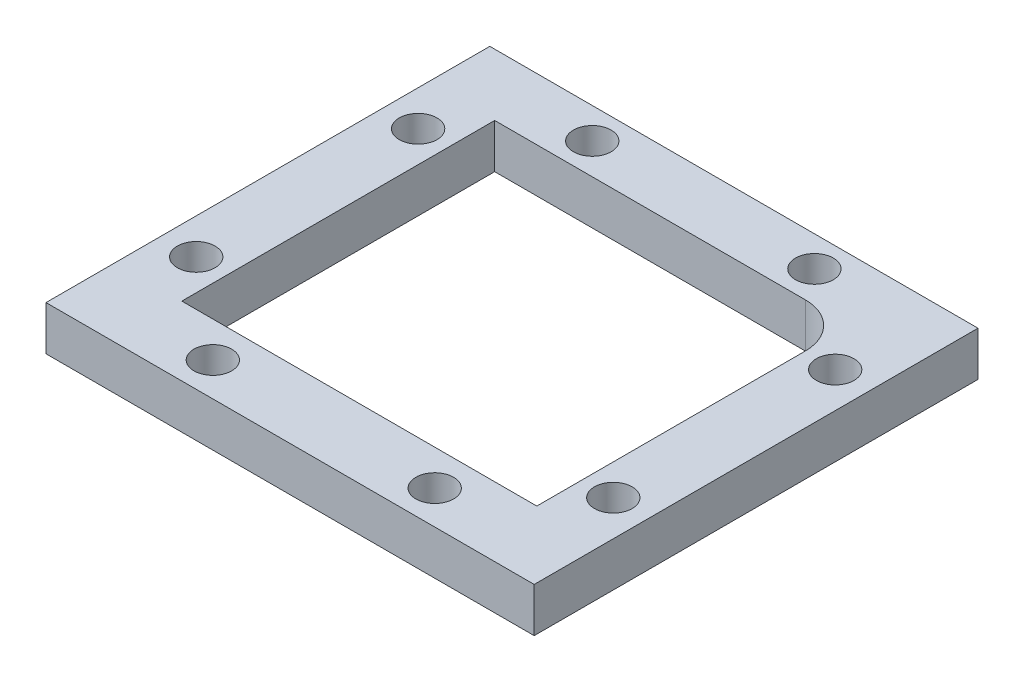
ISO-10303-21;
HEADER;
FILE_DESCRIPTION(('STEP AP214'),'2;1');
FILE_NAME('part.step','',(''),(''),'','','');
FILE_SCHEMA(('AUTOMOTIVE_DESIGN { 1 0 10303 214 1 1 1 1 }'));
ENDSEC;
DATA;
#1=APPLICATION_CONTEXT('core data for automotive mechanical design processes');
#2=APPLICATION_PROTOCOL_DEFINITION('international standard','automotive_design',2000,#1);
#3=PRODUCT_CONTEXT('',#1,'mechanical');
#4=PRODUCT('Part','Part','',(#3));
#5=PRODUCT_RELATED_PRODUCT_CATEGORY('part','',(#4));
#6=PRODUCT_DEFINITION_FORMATION('','',#4);
#7=PRODUCT_DEFINITION_CONTEXT('part definition',#1,'design');
#8=PRODUCT_DEFINITION('design','',#6,#7);
#9=PRODUCT_DEFINITION_SHAPE('','',#8);
#10=(LENGTH_UNIT() NAMED_UNIT(*) SI_UNIT(.MILLI.,.METRE.));
#11=(NAMED_UNIT(*) PLANE_ANGLE_UNIT() SI_UNIT($,.RADIAN.));
#12=(NAMED_UNIT(*) SI_UNIT($,.STERADIAN.) SOLID_ANGLE_UNIT());
#13=UNCERTAINTY_MEASURE_WITH_UNIT(LENGTH_MEASURE(1.E-05),#10,'distance_accuracy_value','');
#14=(GEOMETRIC_REPRESENTATION_CONTEXT(3) GLOBAL_UNCERTAINTY_ASSIGNED_CONTEXT((#13)) GLOBAL_UNIT_ASSIGNED_CONTEXT((#10,
#11,#12)) REPRESENTATION_CONTEXT('',''));
#15=CARTESIAN_POINT('',(0.,0.,0.));
#16=DIRECTION('',(0.,0.,1.));
#17=DIRECTION('',(1.,0.,0.));
#18=AXIS2_PLACEMENT_3D('',#15,#16,#17);
#19=CARTESIAN_POINT('',(0.,35.,0.));
#20=DIRECTION('',(0.,-1.,0.));
#21=DIRECTION('',(0.,0.,-1.));
#22=AXIS2_PLACEMENT_3D('',#19,#20,#21);
#23=PLANE('',#22);
#24=CARTESIAN_POINT('',(-23.4936005393496,35.,10.125));
#25=DIRECTION('',(0.,-1.,0.));
#26=DIRECTION('',(0.,0.,-1.));
#27=AXIS2_PLACEMENT_3D('',#24,#25,#26);
#28=CIRCLE('',#27,2.125);
#29=CARTESIAN_POINT('',(-23.4936005393496,35.,8.));
#30=VERTEX_POINT('',#29);
#31=EDGE_CURVE('E320',#30,#30,#28,.T.);
#32=ORIENTED_EDGE('',*,*,#31,.T.);
#33=EDGE_LOOP('',(#32));
#34=FACE_BOUND('',#33,.T.);
#35=CARTESIAN_POINT('',(12.5,35.,-23.5265194709854));
#36=DIRECTION('',(0.,-1.,0.));
#37=DIRECTION('',(0.,0.,-1.));
#38=AXIS2_PLACEMENT_3D('',#35,#36,#37);
#39=CIRCLE('',#38,2.125);
#40=CARTESIAN_POINT('',(12.5,35.,-25.6515194709854));
#41=VERTEX_POINT('',#40);
#42=EDGE_CURVE('E313',#41,#41,#39,.T.);
#43=ORIENTED_EDGE('',*,*,#42,.T.);
#44=EDGE_LOOP('',(#43));
#45=FACE_BOUND('',#44,.T.);
#46=CARTESIAN_POINT('',(-12.5,35.,-23.5));
#47=DIRECTION('',(0.,-1.,0.));
#48=DIRECTION('',(0.,0.,-1.));
#49=AXIS2_PLACEMENT_3D('',#46,#47,#48);
#50=CIRCLE('',#49,2.125);
#51=CARTESIAN_POINT('',(-12.5,35.,-25.625));
#52=VERTEX_POINT('',#51);
#53=EDGE_CURVE('E331',#52,#52,#50,.T.);
#54=ORIENTED_EDGE('',*,*,#53,.T.);
#55=EDGE_LOOP('',(#54));
#56=FACE_BOUND('',#55,.T.);
#57=CARTESIAN_POINT('',(12.5,35.,19.25));
#58=DIRECTION('',(0.,-1.,0.));
#59=DIRECTION('',(0.,0.,-1.));
#60=AXIS2_PLACEMENT_3D('',#57,#58,#59);
#61=CIRCLE('',#60,2.125);
#62=CARTESIAN_POINT('',(12.5,35.,17.125));
#63=VERTEX_POINT('',#62);
#64=EDGE_CURVE('E324',#63,#63,#61,.T.);
#65=ORIENTED_EDGE('',*,*,#64,.T.);
#66=EDGE_LOOP('',(#65));
#67=FACE_BOUND('',#66,.T.);
#68=CARTESIAN_POINT('',(-23.4936005393496,35.,-14.875));
#69=DIRECTION('',(0.,-1.,0.));
#70=DIRECTION('',(0.,0.,-1.));
#71=AXIS2_PLACEMENT_3D('',#68,#69,#70);
#72=CIRCLE('',#71,2.125);
#73=CARTESIAN_POINT('',(-23.4936005393496,35.,-17.));
#74=VERTEX_POINT('',#73);
#75=EDGE_CURVE('E292',#74,#74,#72,.T.);
#76=ORIENTED_EDGE('',*,*,#75,.T.);
#77=EDGE_LOOP('',(#76));
#78=FACE_BOUND('',#77,.T.);
#79=CARTESIAN_POINT('',(23.4936005393496,35.,-14.875));
#80=DIRECTION('',(0.,-1.,0.));
#81=DIRECTION('',(0.,0.,1.));
#82=AXIS2_PLACEMENT_3D('',#79,#80,#81);
#83=CIRCLE('',#82,2.125);
#84=CARTESIAN_POINT('',(23.4936005393496,35.,-12.75));
#85=VERTEX_POINT('',#84);
#86=EDGE_CURVE('E297',#85,#85,#83,.T.);
#87=ORIENTED_EDGE('',*,*,#86,.T.);
#88=EDGE_LOOP('',(#87));
#89=FACE_BOUND('',#88,.T.);
#90=CARTESIAN_POINT('',(23.4936005393496,35.,10.125));
#91=DIRECTION('',(0.,-1.,0.));
#92=DIRECTION('',(0.,0.,1.));
#93=AXIS2_PLACEMENT_3D('',#90,#91,#92);
#94=CIRCLE('',#93,2.125);
#95=CARTESIAN_POINT('',(23.4936005393496,35.,12.25));
#96=VERTEX_POINT('',#95);
#97=EDGE_CURVE('E307',#96,#96,#94,.T.);
#98=ORIENTED_EDGE('',*,*,#97,.T.);
#99=EDGE_LOOP('',(#98));
#100=FACE_BOUND('',#99,.T.);
#101=CARTESIAN_POINT('',(-12.5,35.,19.25));
#102=DIRECTION('',(0.,-1.,0.));
#103=DIRECTION('',(0.,0.,-1.));
#104=AXIS2_PLACEMENT_3D('',#101,#102,#103);
#105=CIRCLE('',#104,2.125);
#106=CARTESIAN_POINT('',(-12.5,35.,17.125));
#107=VERTEX_POINT('',#106);
#108=EDGE_CURVE('E158',#107,#107,#105,.T.);
#109=ORIENTED_EDGE('',*,*,#108,.T.);
#110=EDGE_LOOP('',(#109));
#111=FACE_BOUND('',#110,.T.);
#112=DIRECTION('',(0.,0.,-1.));
#113=VECTOR('',#112,1.);
#114=CARTESIAN_POINT('',(27.5,35.,23.0435212218331));
#115=LINE('',#114,#113);
#116=CARTESIAN_POINT('',(27.5,35.,23.0435212218331));
#117=VERTEX_POINT('',#116);
#118=CARTESIAN_POINT('',(27.5,35.,-26.9564787781669));
#119=VERTEX_POINT('',#118);
#120=EDGE_CURVE('E173',#117,#119,#115,.T.);
#121=ORIENTED_EDGE('',*,*,#120,.T.);
#122=DIRECTION('',(-1.,0.,0.));
#123=VECTOR('',#122,1.);
#124=CARTESIAN_POINT('',(-27.5,35.,-26.9564787781669));
#125=LINE('',#124,#123);
#126=CARTESIAN_POINT('',(-27.5,35.,-26.9564787781669));
#127=VERTEX_POINT('',#126);
#128=EDGE_CURVE('E176',#119,#127,#125,.T.);
#129=ORIENTED_EDGE('',*,*,#128,.T.);
#130=DIRECTION('',(0.,0.,1.));
#131=VECTOR('',#130,1.);
#132=CARTESIAN_POINT('',(-27.5,35.,23.0435212218331));
#133=LINE('',#132,#131);
#134=CARTESIAN_POINT('',(-27.5,35.,23.0435212218331));
#135=VERTEX_POINT('',#134);
#136=EDGE_CURVE('E179',#127,#135,#133,.T.);
#137=ORIENTED_EDGE('',*,*,#136,.T.);
#138=DIRECTION('',(1.,0.,0.));
#139=VECTOR('',#138,1.);
#140=CARTESIAN_POINT('',(-27.5,35.,23.0435212218331));
#141=LINE('',#140,#139);
#142=EDGE_CURVE('E181',#135,#117,#141,.T.);
#143=ORIENTED_EDGE('',*,*,#142,.T.);
#144=EDGE_LOOP('',(#121,#129,#137,#143));
#145=FACE_BOUND('',#144,.T.);
#146=CARTESIAN_POINT('',(15.,35.,-15.));
#147=DIRECTION('',(0.,1.,0.));
#148=DIRECTION('',(0.,0.,1.));
#149=AXIS2_PLACEMENT_3D('',#146,#147,#148);
#150=CIRCLE('',#149,5.);
#151=CARTESIAN_POINT('',(20.,35.,-15.));
#152=VERTEX_POINT('',#151);
#153=CARTESIAN_POINT('',(15.,35.,-20.));
#154=VERTEX_POINT('',#153);
#155=EDGE_CURVE('E127',#152,#154,#150,.T.);
#156=ORIENTED_EDGE('',*,*,#155,.F.);
#157=DIRECTION('',(0.,0.,-1.));
#158=VECTOR('',#157,1.);
#159=CARTESIAN_POINT('',(20.,35.,15.25));
#160=LINE('',#159,#158);
#161=CARTESIAN_POINT('',(20.,35.,15.25));
#162=VERTEX_POINT('',#161);
#163=EDGE_CURVE('E155',#162,#152,#160,.T.);
#164=ORIENTED_EDGE('',*,*,#163,.F.);
#165=DIRECTION('',(1.,0.,0.));
#166=VECTOR('',#165,1.);
#167=CARTESIAN_POINT('',(-19.9936005393496,35.,15.25));
#168=LINE('',#167,#166);
#169=CARTESIAN_POINT('',(-19.9936005393496,35.,15.25));
#170=VERTEX_POINT('',#169);
#171=EDGE_CURVE('E150',#170,#162,#168,.T.);
#172=ORIENTED_EDGE('',*,*,#171,.F.);
#173=DIRECTION('',(0.,0.,1.));
#174=VECTOR('',#173,1.);
#175=CARTESIAN_POINT('',(-19.9936005393496,35.,-20.));
#176=LINE('',#175,#174);
#177=CARTESIAN_POINT('',(-19.9936005393496,35.,-20.));
#178=VERTEX_POINT('',#177);
#179=EDGE_CURVE('E148',#178,#170,#176,.T.);
#180=ORIENTED_EDGE('',*,*,#179,.F.);
#181=DIRECTION('',(-1.,0.,0.));
#182=VECTOR('',#181,1.);
#183=CARTESIAN_POINT('',(15.,35.,-20.));
#184=LINE('',#183,#182);
#185=EDGE_CURVE('E135',#154,#178,#184,.T.);
#186=ORIENTED_EDGE('',*,*,#185,.F.);
#187=EDGE_LOOP('',(#156,#164,#172,#180,#186));
#188=FACE_BOUND('',#187,.T.);
#189=ADVANCED_FACE('F56',(#34,#45,#56,#67,#78,#89,#100,#111,#145,#188),#23,.F.);
#190=CARTESIAN_POINT('',(0.,30.,0.));
#191=DIRECTION('',(0.,-1.,0.));
#192=DIRECTION('',(0.,0.,-1.));
#193=AXIS2_PLACEMENT_3D('',#190,#191,#192);
#194=PLANE('',#193);
#195=CARTESIAN_POINT('',(-23.4936005393496,30.,10.125));
#196=DIRECTION('',(0.,-1.,0.));
#197=DIRECTION('',(0.,0.,-1.));
#198=AXIS2_PLACEMENT_3D('',#195,#196,#197);
#199=CIRCLE('',#198,2.125);
#200=CARTESIAN_POINT('',(-23.4936005393496,30.,8.));
#201=VERTEX_POINT('',#200);
#202=EDGE_CURVE('E299',#201,#201,#199,.T.);
#203=ORIENTED_EDGE('',*,*,#202,.F.);
#204=EDGE_LOOP('',(#203));
#205=FACE_BOUND('',#204,.T.);
#206=CARTESIAN_POINT('',(12.5,30.,-23.5265194709854));
#207=DIRECTION('',(0.,-1.,0.));
#208=DIRECTION('',(0.,0.,-1.));
#209=AXIS2_PLACEMENT_3D('',#206,#207,#208);
#210=CIRCLE('',#209,2.125);
#211=CARTESIAN_POINT('',(12.5,30.,-25.6515194709854));
#212=VERTEX_POINT('',#211);
#213=EDGE_CURVE('E317',#212,#212,#210,.T.);
#214=ORIENTED_EDGE('',*,*,#213,.F.);
#215=EDGE_LOOP('',(#214));
#216=FACE_BOUND('',#215,.T.);
#217=CARTESIAN_POINT('',(-12.5,30.,-23.5));
#218=DIRECTION('',(0.,-1.,0.));
#219=DIRECTION('',(0.,0.,-1.));
#220=AXIS2_PLACEMENT_3D('',#217,#218,#219);
#221=CIRCLE('',#220,2.125);
#222=CARTESIAN_POINT('',(-12.5,30.,-25.625));
#223=VERTEX_POINT('',#222);
#224=EDGE_CURVE('E316',#223,#223,#221,.T.);
#225=ORIENTED_EDGE('',*,*,#224,.F.);
#226=EDGE_LOOP('',(#225));
#227=FACE_BOUND('',#226,.T.);
#228=CARTESIAN_POINT('',(12.5,30.,19.25));
#229=DIRECTION('',(0.,-1.,0.));
#230=DIRECTION('',(0.,0.,-1.));
#231=AXIS2_PLACEMENT_3D('',#228,#229,#230);
#232=CIRCLE('',#231,2.125);
#233=CARTESIAN_POINT('',(12.5,30.,17.125));
#234=VERTEX_POINT('',#233);
#235=EDGE_CURVE('E328',#234,#234,#232,.T.);
#236=ORIENTED_EDGE('',*,*,#235,.F.);
#237=EDGE_LOOP('',(#236));
#238=FACE_BOUND('',#237,.T.);
#239=CARTESIAN_POINT('',(-23.4936005393496,30.,-14.875));
#240=DIRECTION('',(0.,-1.,0.));
#241=DIRECTION('',(0.,0.,-1.));
#242=AXIS2_PLACEMENT_3D('',#239,#240,#241);
#243=CIRCLE('',#242,2.125);
#244=CARTESIAN_POINT('',(-23.4936005393496,30.,-17.));
#245=VERTEX_POINT('',#244);
#246=EDGE_CURVE('E295',#245,#245,#243,.T.);
#247=ORIENTED_EDGE('',*,*,#246,.F.);
#248=EDGE_LOOP('',(#247));
#249=FACE_BOUND('',#248,.T.);
#250=CARTESIAN_POINT('',(23.4936005393496,30.,-14.875));
#251=DIRECTION('',(0.,-1.,0.));
#252=DIRECTION('',(0.,0.,1.));
#253=AXIS2_PLACEMENT_3D('',#250,#251,#252);
#254=CIRCLE('',#253,2.125);
#255=CARTESIAN_POINT('',(23.4936005393496,30.,-12.75));
#256=VERTEX_POINT('',#255);
#257=EDGE_CURVE('E302',#256,#256,#254,.T.);
#258=ORIENTED_EDGE('',*,*,#257,.F.);
#259=EDGE_LOOP('',(#258));
#260=FACE_BOUND('',#259,.T.);
#261=CARTESIAN_POINT('',(23.4936005393496,30.,10.125));
#262=DIRECTION('',(0.,-1.,0.));
#263=DIRECTION('',(0.,0.,1.));
#264=AXIS2_PLACEMENT_3D('',#261,#262,#263);
#265=CIRCLE('',#264,2.125);
#266=CARTESIAN_POINT('',(23.4936005393496,30.,12.25));
#267=VERTEX_POINT('',#266);
#268=EDGE_CURVE('E310',#267,#267,#265,.T.);
#269=ORIENTED_EDGE('',*,*,#268,.F.);
#270=EDGE_LOOP('',(#269));
#271=FACE_BOUND('',#270,.T.);
#272=CARTESIAN_POINT('',(-12.5,30.,19.25));
#273=DIRECTION('',(0.,-1.,0.));
#274=DIRECTION('',(0.,0.,-1.));
#275=AXIS2_PLACEMENT_3D('',#272,#273,#274);
#276=CIRCLE('',#275,2.125);
#277=CARTESIAN_POINT('',(-12.5,30.,17.125));
#278=VERTEX_POINT('',#277);
#279=EDGE_CURVE('E327',#278,#278,#276,.T.);
#280=ORIENTED_EDGE('',*,*,#279,.F.);
#281=EDGE_LOOP('',(#280));
#282=FACE_BOUND('',#281,.T.);
#283=CARTESIAN_POINT('',(15.,30.,-15.));
#284=DIRECTION('',(0.,1.,0.));
#285=DIRECTION('',(0.,0.,1.));
#286=AXIS2_PLACEMENT_3D('',#283,#284,#285);
#287=CIRCLE('',#286,5.);
#288=CARTESIAN_POINT('',(20.,30.,-15.));
#289=VERTEX_POINT('',#288);
#290=CARTESIAN_POINT('',(15.,30.,-20.));
#291=VERTEX_POINT('',#290);
#292=EDGE_CURVE('E79',#289,#291,#287,.T.);
#293=ORIENTED_EDGE('',*,*,#292,.T.);
#294=DIRECTION('',(-1.,0.,0.));
#295=VECTOR('',#294,1.);
#296=CARTESIAN_POINT('',(15.,30.,-20.));
#297=LINE('',#296,#295);
#298=CARTESIAN_POINT('',(-19.9936005393496,30.,-20.));
#299=VERTEX_POINT('',#298);
#300=EDGE_CURVE('E142',#291,#299,#297,.T.);
#301=ORIENTED_EDGE('',*,*,#300,.T.);
#302=DIRECTION('',(0.,0.,1.));
#303=VECTOR('',#302,1.);
#304=CARTESIAN_POINT('',(-19.9936005393496,30.,-20.));
#305=LINE('',#304,#303);
#306=CARTESIAN_POINT('',(-19.9936005393496,30.,15.25));
#307=VERTEX_POINT('',#306);
#308=EDGE_CURVE('E160',#299,#307,#305,.T.);
#309=ORIENTED_EDGE('',*,*,#308,.T.);
#310=DIRECTION('',(1.,0.,0.));
#311=VECTOR('',#310,1.);
#312=CARTESIAN_POINT('',(-19.9936005393496,30.,15.25));
#313=LINE('',#312,#311);
#314=CARTESIAN_POINT('',(20.,30.,15.25));
#315=VERTEX_POINT('',#314);
#316=EDGE_CURVE('E163',#307,#315,#313,.T.);
#317=ORIENTED_EDGE('',*,*,#316,.T.);
#318=DIRECTION('',(0.,0.,-1.));
#319=VECTOR('',#318,1.);
#320=CARTESIAN_POINT('',(20.,30.,15.25));
#321=LINE('',#320,#319);
#322=EDGE_CURVE('E136',#315,#289,#321,.T.);
#323=ORIENTED_EDGE('',*,*,#322,.T.);
#324=EDGE_LOOP('',(#293,#301,#309,#317,#323));
#325=FACE_BOUND('',#324,.T.);
#326=DIRECTION('',(1.,0.,0.));
#327=VECTOR('',#326,1.);
#328=CARTESIAN_POINT('',(-27.5,30.,23.0435212218331));
#329=LINE('',#328,#327);
#330=CARTESIAN_POINT('',(-27.5,30.,23.0435212218331));
#331=VERTEX_POINT('',#330);
#332=CARTESIAN_POINT('',(27.5,30.,23.0435212218331));
#333=VERTEX_POINT('',#332);
#334=EDGE_CURVE('E177',#331,#333,#329,.T.);
#335=ORIENTED_EDGE('',*,*,#334,.F.);
#336=DIRECTION('',(0.,0.,1.));
#337=VECTOR('',#336,1.);
#338=CARTESIAN_POINT('',(-27.5,30.,23.0435212218331));
#339=LINE('',#338,#337);
#340=CARTESIAN_POINT('',(-27.5,30.,-26.9564787781669));
#341=VERTEX_POINT('',#340);
#342=EDGE_CURVE('E187',#341,#331,#339,.T.);
#343=ORIENTED_EDGE('',*,*,#342,.F.);
#344=DIRECTION('',(-1.,0.,0.));
#345=VECTOR('',#344,1.);
#346=CARTESIAN_POINT('',(-27.5,30.,-26.9564787781669));
#347=LINE('',#346,#345);
#348=CARTESIAN_POINT('',(27.5,30.,-26.9564787781669));
#349=VERTEX_POINT('',#348);
#350=EDGE_CURVE('E185',#349,#341,#347,.T.);
#351=ORIENTED_EDGE('',*,*,#350,.F.);
#352=DIRECTION('',(0.,0.,-1.));
#353=VECTOR('',#352,1.);
#354=CARTESIAN_POINT('',(27.5,30.,23.0435212218331));
#355=LINE('',#354,#353);
#356=EDGE_CURVE('E143',#333,#349,#355,.T.);
#357=ORIENTED_EDGE('',*,*,#356,.F.);
#358=EDGE_LOOP('',(#335,#343,#351,#357));
#359=FACE_BOUND('',#358,.T.);
#360=ADVANCED_FACE('F205',(#205,#216,#227,#238,#249,#260,#271,#282,#325,#359),#194,.T.);
#361=CARTESIAN_POINT('',(27.5,35.,23.0435212218331));
#362=DIRECTION('',(-1.,0.,0.));
#363=DIRECTION('',(0.,0.,1.));
#364=AXIS2_PLACEMENT_3D('',#361,#362,#363);
#365=PLANE('',#364);
#366=ORIENTED_EDGE('',*,*,#356,.T.);
#367=DIRECTION('',(0.,-1.,0.));
#368=VECTOR('',#367,1.);
#369=CARTESIAN_POINT('',(27.5,35.,-26.9564787781669));
#370=LINE('',#369,#368);
#371=EDGE_CURVE('E12',#119,#349,#370,.T.);
#372=ORIENTED_EDGE('',*,*,#371,.F.);
#373=ORIENTED_EDGE('',*,*,#120,.F.);
#374=DIRECTION('',(0.,-1.,0.));
#375=VECTOR('',#374,1.);
#376=CARTESIAN_POINT('',(27.5,35.,23.0435212218331));
#377=LINE('',#376,#375);
#378=EDGE_CURVE('E183',#117,#333,#377,.T.);
#379=ORIENTED_EDGE('',*,*,#378,.T.);
#380=EDGE_LOOP('',(#366,#372,#373,#379));
#381=FACE_BOUND('',#380,.T.);
#382=ADVANCED_FACE('F58',(#381),#365,.F.);
#383=CARTESIAN_POINT('',(-27.5,35.,-26.9564787781669));
#384=DIRECTION('',(0.,0.,1.));
#385=DIRECTION('',(1.,0.,0.));
#386=AXIS2_PLACEMENT_3D('',#383,#384,#385);
#387=PLANE('',#386);
#388=ORIENTED_EDGE('',*,*,#350,.T.);
#389=DIRECTION('',(0.,-1.,0.));
#390=VECTOR('',#389,1.);
#391=CARTESIAN_POINT('',(-27.5,35.,-26.9564787781669));
#392=LINE('',#391,#390);
#393=EDGE_CURVE('E64',#127,#341,#392,.T.);
#394=ORIENTED_EDGE('',*,*,#393,.F.);
#395=ORIENTED_EDGE('',*,*,#128,.F.);
#396=ORIENTED_EDGE('',*,*,#371,.T.);
#397=EDGE_LOOP('',(#388,#394,#395,#396));
#398=FACE_BOUND('',#397,.T.);
#399=ADVANCED_FACE('F215',(#398),#387,.F.);
#400=CARTESIAN_POINT('',(-27.5,35.,23.0435212218331));
#401=DIRECTION('',(1.,0.,0.));
#402=DIRECTION('',(0.,0.,-1.));
#403=AXIS2_PLACEMENT_3D('',#400,#401,#402);
#404=PLANE('',#403);
#405=ORIENTED_EDGE('',*,*,#342,.T.);
#406=DIRECTION('',(0.,-1.,0.));
#407=VECTOR('',#406,1.);
#408=CARTESIAN_POINT('',(-27.5,35.,23.0435212218331));
#409=LINE('',#408,#407);
#410=EDGE_CURVE('E192',#135,#331,#409,.T.);
#411=ORIENTED_EDGE('',*,*,#410,.F.);
#412=ORIENTED_EDGE('',*,*,#136,.F.);
#413=ORIENTED_EDGE('',*,*,#393,.T.);
#414=EDGE_LOOP('',(#405,#411,#412,#413));
#415=FACE_BOUND('',#414,.T.);
#416=ADVANCED_FACE('F199',(#415),#404,.F.);
#417=CARTESIAN_POINT('',(-27.5,35.,23.0435212218331));
#418=DIRECTION('',(0.,0.,-1.));
#419=DIRECTION('',(-1.,0.,0.));
#420=AXIS2_PLACEMENT_3D('',#417,#418,#419);
#421=PLANE('',#420);
#422=ORIENTED_EDGE('',*,*,#334,.T.);
#423=ORIENTED_EDGE('',*,*,#378,.F.);
#424=ORIENTED_EDGE('',*,*,#142,.F.);
#425=ORIENTED_EDGE('',*,*,#410,.T.);
#426=EDGE_LOOP('',(#422,#423,#424,#425));
#427=FACE_BOUND('',#426,.T.);
#428=ADVANCED_FACE('F209',(#427),#421,.F.);
#429=CARTESIAN_POINT('',(15.,35.,-15.));
#430=DIRECTION('',(0.,-1.,0.));
#431=DIRECTION('',(0.,0.,-1.));
#432=AXIS2_PLACEMENT_3D('',#429,#430,#431);
#433=CYLINDRICAL_SURFACE('',#432,5.);
#434=ORIENTED_EDGE('',*,*,#292,.F.);
#435=DIRECTION('',(0.,-1.,0.));
#436=VECTOR('',#435,1.);
#437=CARTESIAN_POINT('',(20.,35.,-15.));
#438=LINE('',#437,#436);
#439=EDGE_CURVE('E131',#152,#289,#438,.T.);
#440=ORIENTED_EDGE('',*,*,#439,.F.);
#441=ORIENTED_EDGE('',*,*,#155,.T.);
#442=DIRECTION('',(0.,-1.,0.));
#443=VECTOR('',#442,1.);
#444=CARTESIAN_POINT('',(15.,35.,-20.));
#445=LINE('',#444,#443);
#446=EDGE_CURVE('E130',#154,#291,#445,.T.);
#447=ORIENTED_EDGE('',*,*,#446,.T.);
#448=EDGE_LOOP('',(#434,#440,#441,#447));
#449=FACE_BOUND('',#448,.T.);
#450=ADVANCED_FACE('F129',(#449),#433,.F.);
#451=CARTESIAN_POINT('',(15.,35.,-20.));
#452=DIRECTION('',(0.,0.,1.));
#453=DIRECTION('',(1.,0.,0.));
#454=AXIS2_PLACEMENT_3D('',#451,#452,#453);
#455=PLANE('',#454);
#456=ORIENTED_EDGE('',*,*,#300,.F.);
#457=ORIENTED_EDGE('',*,*,#446,.F.);
#458=ORIENTED_EDGE('',*,*,#185,.T.);
#459=DIRECTION('',(0.,-1.,0.));
#460=VECTOR('',#459,1.);
#461=CARTESIAN_POINT('',(-19.9936005393496,35.,-20.));
#462=LINE('',#461,#460);
#463=EDGE_CURVE('E144',#178,#299,#462,.T.);
#464=ORIENTED_EDGE('',*,*,#463,.T.);
#465=EDGE_LOOP('',(#456,#457,#458,#464));
#466=FACE_BOUND('',#465,.T.);
#467=ADVANCED_FACE('F139',(#466),#455,.T.);
#468=CARTESIAN_POINT('',(-19.9936005393496,35.,-20.));
#469=DIRECTION('',(1.,0.,0.));
#470=DIRECTION('',(0.,0.,-1.));
#471=AXIS2_PLACEMENT_3D('',#468,#469,#470);
#472=PLANE('',#471);
#473=ORIENTED_EDGE('',*,*,#308,.F.);
#474=ORIENTED_EDGE('',*,*,#463,.F.);
#475=ORIENTED_EDGE('',*,*,#179,.T.);
#476=DIRECTION('',(0.,-1.,0.));
#477=VECTOR('',#476,1.);
#478=CARTESIAN_POINT('',(-19.9936005393496,35.,15.25));
#479=LINE('',#478,#477);
#480=EDGE_CURVE('E170',#170,#307,#479,.T.);
#481=ORIENTED_EDGE('',*,*,#480,.T.);
#482=EDGE_LOOP('',(#473,#474,#475,#481));
#483=FACE_BOUND('',#482,.T.);
#484=ADVANCED_FACE('F242',(#483),#472,.T.);
#485=CARTESIAN_POINT('',(-19.9936005393496,35.,15.25));
#486=DIRECTION('',(0.,0.,-1.));
#487=DIRECTION('',(-1.,0.,0.));
#488=AXIS2_PLACEMENT_3D('',#485,#486,#487);
#489=PLANE('',#488);
#490=ORIENTED_EDGE('',*,*,#316,.F.);
#491=ORIENTED_EDGE('',*,*,#480,.F.);
#492=ORIENTED_EDGE('',*,*,#171,.T.);
#493=DIRECTION('',(0.,-1.,0.));
#494=VECTOR('',#493,1.);
#495=CARTESIAN_POINT('',(20.,35.,15.25));
#496=LINE('',#495,#494);
#497=EDGE_CURVE('E71',#162,#315,#496,.T.);
#498=ORIENTED_EDGE('',*,*,#497,.T.);
#499=EDGE_LOOP('',(#490,#491,#492,#498));
#500=FACE_BOUND('',#499,.T.);
#501=ADVANCED_FACE('F246',(#500),#489,.T.);
#502=CARTESIAN_POINT('',(20.,35.,15.25));
#503=DIRECTION('',(-1.,0.,0.));
#504=DIRECTION('',(0.,0.,1.));
#505=AXIS2_PLACEMENT_3D('',#502,#503,#504);
#506=PLANE('',#505);
#507=ORIENTED_EDGE('',*,*,#322,.F.);
#508=ORIENTED_EDGE('',*,*,#497,.F.);
#509=ORIENTED_EDGE('',*,*,#163,.T.);
#510=ORIENTED_EDGE('',*,*,#439,.T.);
#511=EDGE_LOOP('',(#507,#508,#509,#510));
#512=FACE_BOUND('',#511,.T.);
#513=ADVANCED_FACE('F252',(#512),#506,.T.);
#514=CARTESIAN_POINT('',(-12.5,35.,19.25));
#515=DIRECTION('',(0.,-1.,0.));
#516=DIRECTION('',(0.,0.,-1.));
#517=AXIS2_PLACEMENT_3D('',#514,#515,#516);
#518=CYLINDRICAL_SURFACE('',#517,2.125);
#519=ORIENTED_EDGE('',*,*,#108,.F.);
#520=EDGE_LOOP('',(#519));
#521=FACE_BOUND('',#520,.T.);
#522=ORIENTED_EDGE('',*,*,#279,.T.);
#523=EDGE_LOOP('',(#522));
#524=FACE_BOUND('',#523,.T.);
#525=ADVANCED_FACE('F256',(#521,#524),#518,.F.);
#526=CARTESIAN_POINT('',(23.4936005393496,35.,10.125));
#527=DIRECTION('',(0.,-1.,0.));
#528=DIRECTION('',(0.,0.,-1.));
#529=AXIS2_PLACEMENT_3D('',#526,#527,#528);
#530=CYLINDRICAL_SURFACE('',#529,2.125);
#531=ORIENTED_EDGE('',*,*,#97,.F.);
#532=EDGE_LOOP('',(#531));
#533=FACE_BOUND('',#532,.T.);
#534=ORIENTED_EDGE('',*,*,#268,.T.);
#535=EDGE_LOOP('',(#534));
#536=FACE_BOUND('',#535,.T.);
#537=ADVANCED_FACE('F259',(#533,#536),#530,.F.);
#538=CARTESIAN_POINT('',(23.4936005393496,35.,-14.875));
#539=DIRECTION('',(0.,-1.,0.));
#540=DIRECTION('',(0.,0.,-1.));
#541=AXIS2_PLACEMENT_3D('',#538,#539,#540);
#542=CYLINDRICAL_SURFACE('',#541,2.125);
#543=ORIENTED_EDGE('',*,*,#86,.F.);
#544=EDGE_LOOP('',(#543));
#545=FACE_BOUND('',#544,.T.);
#546=ORIENTED_EDGE('',*,*,#257,.T.);
#547=EDGE_LOOP('',(#546));
#548=FACE_BOUND('',#547,.T.);
#549=ADVANCED_FACE('F280',(#545,#548),#542,.F.);
#550=CARTESIAN_POINT('',(-23.4936005393496,35.,-14.875));
#551=DIRECTION('',(0.,-1.,0.));
#552=DIRECTION('',(0.,0.,-1.));
#553=AXIS2_PLACEMENT_3D('',#550,#551,#552);
#554=CYLINDRICAL_SURFACE('',#553,2.125);
#555=ORIENTED_EDGE('',*,*,#75,.F.);
#556=EDGE_LOOP('',(#555));
#557=FACE_BOUND('',#556,.T.);
#558=ORIENTED_EDGE('',*,*,#246,.T.);
#559=EDGE_LOOP('',(#558));
#560=FACE_BOUND('',#559,.T.);
#561=ADVANCED_FACE('F269',(#557,#560),#554,.F.);
#562=CARTESIAN_POINT('',(12.5,35.,19.25));
#563=DIRECTION('',(0.,-1.,0.));
#564=DIRECTION('',(0.,0.,-1.));
#565=AXIS2_PLACEMENT_3D('',#562,#563,#564);
#566=CYLINDRICAL_SURFACE('',#565,2.125);
#567=ORIENTED_EDGE('',*,*,#64,.F.);
#568=EDGE_LOOP('',(#567));
#569=FACE_BOUND('',#568,.T.);
#570=ORIENTED_EDGE('',*,*,#235,.T.);
#571=EDGE_LOOP('',(#570));
#572=FACE_BOUND('',#571,.T.);
#573=ADVANCED_FACE('F265',(#569,#572),#566,.F.);
#574=CARTESIAN_POINT('',(-12.5,35.,-23.5));
#575=DIRECTION('',(0.,-1.,0.));
#576=DIRECTION('',(0.,0.,-1.));
#577=AXIS2_PLACEMENT_3D('',#574,#575,#576);
#578=CYLINDRICAL_SURFACE('',#577,2.125);
#579=ORIENTED_EDGE('',*,*,#53,.F.);
#580=EDGE_LOOP('',(#579));
#581=FACE_BOUND('',#580,.T.);
#582=ORIENTED_EDGE('',*,*,#224,.T.);
#583=EDGE_LOOP('',(#582));
#584=FACE_BOUND('',#583,.T.);
#585=ADVANCED_FACE('F261',(#581,#584),#578,.F.);
#586=CARTESIAN_POINT('',(12.5,35.,-23.5265194709854));
#587=DIRECTION('',(0.,-1.,0.));
#588=DIRECTION('',(0.,0.,-1.));
#589=AXIS2_PLACEMENT_3D('',#586,#587,#588);
#590=CYLINDRICAL_SURFACE('',#589,2.125);
#591=ORIENTED_EDGE('',*,*,#42,.F.);
#592=EDGE_LOOP('',(#591));
#593=FACE_BOUND('',#592,.T.);
#594=ORIENTED_EDGE('',*,*,#213,.T.);
#595=EDGE_LOOP('',(#594));
#596=FACE_BOUND('',#595,.T.);
#597=ADVANCED_FACE('F264',(#593,#596),#590,.F.);
#598=CARTESIAN_POINT('',(-23.4936005393496,35.,10.125));
#599=DIRECTION('',(0.,-1.,0.));
#600=DIRECTION('',(0.,0.,-1.));
#601=AXIS2_PLACEMENT_3D('',#598,#599,#600);
#602=CYLINDRICAL_SURFACE('',#601,2.125);
#603=ORIENTED_EDGE('',*,*,#31,.F.);
#604=EDGE_LOOP('',(#603));
#605=FACE_BOUND('',#604,.T.);
#606=ORIENTED_EDGE('',*,*,#202,.T.);
#607=EDGE_LOOP('',(#606));
#608=FACE_BOUND('',#607,.T.);
#609=ADVANCED_FACE('F271',(#605,#608),#602,.F.);
#610=CLOSED_SHELL('',(#189,#360,#382,#399,#416,#428,#450,#467,#484,#501,#513,#525,#537,#549,
#561,#573,#585,#597,#609));
#611=MANIFOLD_SOLID_BREP('B2',#610);
#612=ADVANCED_BREP_SHAPE_REPRESENTATION('',(#18,#611),#14);
#613=SHAPE_DEFINITION_REPRESENTATION(#9,#612);
ENDSEC;
END-ISO-10303-21;
